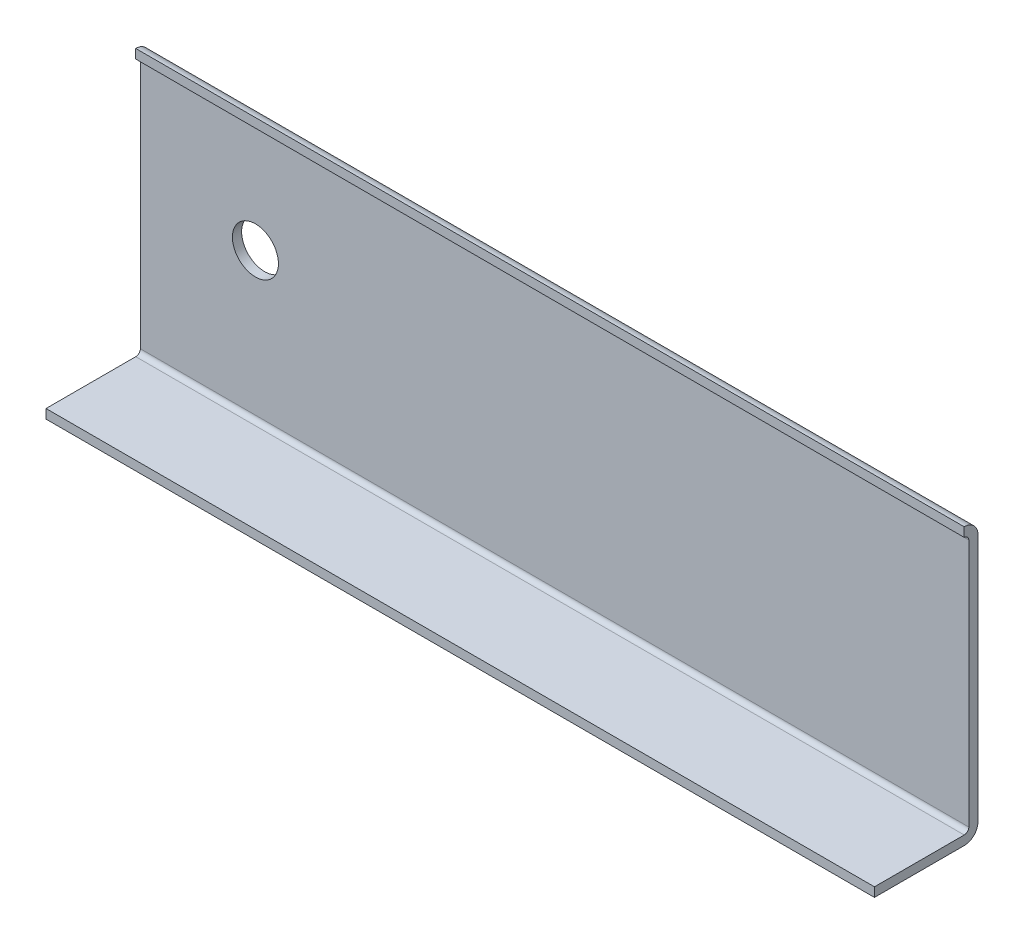
ISO-10303-21;
HEADER;
FILE_DESCRIPTION(('STEP AP214'),'2;1');
FILE_NAME('part.step','',(''),(''),'','','');
FILE_SCHEMA(('AUTOMOTIVE_DESIGN { 1 0 10303 214 1 1 1 1 }'));
ENDSEC;
DATA;
#1=APPLICATION_CONTEXT('core data for automotive mechanical design processes');
#2=APPLICATION_PROTOCOL_DEFINITION('international standard','automotive_design',2000,#1);
#3=PRODUCT_CONTEXT('',#1,'mechanical');
#4=PRODUCT('Part','Part','',(#3));
#5=PRODUCT_RELATED_PRODUCT_CATEGORY('part','',(#4));
#6=PRODUCT_DEFINITION_FORMATION('','',#4);
#7=PRODUCT_DEFINITION_CONTEXT('part definition',#1,'design');
#8=PRODUCT_DEFINITION('design','',#6,#7);
#9=PRODUCT_DEFINITION_SHAPE('','',#8);
#10=(LENGTH_UNIT() NAMED_UNIT(*) SI_UNIT(.MILLI.,.METRE.));
#11=(NAMED_UNIT(*) PLANE_ANGLE_UNIT() SI_UNIT($,.RADIAN.));
#12=(NAMED_UNIT(*) SI_UNIT($,.STERADIAN.) SOLID_ANGLE_UNIT());
#13=UNCERTAINTY_MEASURE_WITH_UNIT(LENGTH_MEASURE(1.E-05),#10,'distance_accuracy_value','');
#14=(GEOMETRIC_REPRESENTATION_CONTEXT(3) GLOBAL_UNCERTAINTY_ASSIGNED_CONTEXT((#13)) GLOBAL_UNIT_ASSIGNED_CONTEXT((#10,
#11,#12)) REPRESENTATION_CONTEXT('',''));
#15=CARTESIAN_POINT('',(0.,0.,0.));
#16=DIRECTION('',(0.,0.,1.));
#17=DIRECTION('',(1.,0.,0.));
#18=AXIS2_PLACEMENT_3D('',#15,#16,#17);
#19=CARTESIAN_POINT('',(180.,1.,-1.));
#20=DIRECTION('',(-1.,0.,0.));
#21=DIRECTION('',(0.,0.,1.));
#22=AXIS2_PLACEMENT_3D('',#19,#20,#21);
#23=PLANE('',#22);
#24=CARTESIAN_POINT('',(180.,55.,-35.));
#25=DIRECTION('',(-1.,0.,0.));
#26=DIRECTION('',(0.,0.,1.));
#27=AXIS2_PLACEMENT_3D('',#24,#25,#26);
#28=CIRCLE('',#27,3.);
#29=CARTESIAN_POINT('',(180.,55.,-38.));
#30=VERTEX_POINT('',#29);
#31=CARTESIAN_POINT('',(180.,58.,-35.));
#32=VERTEX_POINT('',#31);
#33=EDGE_CURVE('E178',#30,#32,#28,.F.);
#34=ORIENTED_EDGE('',*,*,#33,.T.);
#35=DIRECTION('',(0.,1.,0.));
#36=VECTOR('',#35,1.);
#37=CARTESIAN_POINT('',(180.,33.,-35.));
#38=LINE('',#37,#36);
#39=CARTESIAN_POINT('',(180.,56.,-35.));
#40=VERTEX_POINT('',#39);
#41=EDGE_CURVE('E166',#40,#32,#38,.T.);
#42=ORIENTED_EDGE('',*,*,#41,.F.);
#43=CARTESIAN_POINT('',(180.,55.,-35.));
#44=DIRECTION('',(1.,0.,0.));
#45=DIRECTION('',(0.,0.,-1.));
#46=AXIS2_PLACEMENT_3D('',#43,#44,#45);
#47=CIRCLE('',#46,1.);
#48=CARTESIAN_POINT('',(180.,55.,-36.));
#49=VERTEX_POINT('',#48);
#50=EDGE_CURVE('E221',#49,#40,#47,.T.);
#51=ORIENTED_EDGE('',*,*,#50,.F.);
#52=DIRECTION('',(0.,1.,0.));
#53=VECTOR('',#52,1.);
#54=CARTESIAN_POINT('',(180.,1.,-36.));
#55=LINE('',#54,#53);
#56=CARTESIAN_POINT('',(180.,1.,-36.));
#57=VERTEX_POINT('',#56);
#58=EDGE_CURVE('E235',#57,#49,#55,.T.);
#59=ORIENTED_EDGE('',*,*,#58,.F.);
#60=CARTESIAN_POINT('',(180.,1.,-35.));
#61=DIRECTION('',(1.,0.,0.));
#62=DIRECTION('',(0.,0.,-1.));
#63=AXIS2_PLACEMENT_3D('',#60,#61,#62);
#64=CIRCLE('',#63,1.);
#65=CARTESIAN_POINT('',(180.,0.,-35.));
#66=VERTEX_POINT('',#65);
#67=EDGE_CURVE('E237',#66,#57,#64,.T.);
#68=ORIENTED_EDGE('',*,*,#67,.F.);
#69=DIRECTION('',(0.,0.,-1.));
#70=VECTOR('',#69,1.);
#71=CARTESIAN_POINT('',(180.,0.,-1.));
#72=LINE('',#71,#70);
#73=CARTESIAN_POINT('',(180.,0.,-15.5));
#74=VERTEX_POINT('',#73);
#75=EDGE_CURVE('E225',#74,#66,#72,.T.);
#76=ORIENTED_EDGE('',*,*,#75,.F.);
#77=DIRECTION('',(0.,-1.,0.));
#78=VECTOR('',#77,1.);
#79=CARTESIAN_POINT('',(180.,43.,-15.5));
#80=LINE('',#79,#78);
#81=CARTESIAN_POINT('',(180.,-2.,-15.5));
#82=VERTEX_POINT('',#81);
#83=EDGE_CURVE('E96',#74,#82,#80,.T.);
#84=ORIENTED_EDGE('',*,*,#83,.T.);
#85=DIRECTION('',(0.,0.,-1.));
#86=VECTOR('',#85,1.);
#87=CARTESIAN_POINT('',(180.,-2.,-1.));
#88=LINE('',#87,#86);
#89=CARTESIAN_POINT('',(180.,-2.,-35.));
#90=VERTEX_POINT('',#89);
#91=EDGE_CURVE('E126',#82,#90,#88,.T.);
#92=ORIENTED_EDGE('',*,*,#91,.T.);
#93=CARTESIAN_POINT('',(180.,1.,-35.));
#94=DIRECTION('',(-1.,0.,0.));
#95=DIRECTION('',(0.,0.,1.));
#96=AXIS2_PLACEMENT_3D('',#93,#94,#95);
#97=CIRCLE('',#96,3.);
#98=CARTESIAN_POINT('',(180.,1.,-38.));
#99=VERTEX_POINT('',#98);
#100=EDGE_CURVE('E200',#90,#99,#97,.F.);
#101=ORIENTED_EDGE('',*,*,#100,.T.);
#102=DIRECTION('',(0.,1.,0.));
#103=VECTOR('',#102,1.);
#104=CARTESIAN_POINT('',(180.,1.,-38.));
#105=LINE('',#104,#103);
#106=EDGE_CURVE('E105',#99,#30,#105,.T.);
#107=ORIENTED_EDGE('',*,*,#106,.T.);
#108=EDGE_LOOP('',(#34,#42,#51,#59,#68,#76,#84,#92,#101,#107));
#109=FACE_BOUND('',#108,.T.);
#110=ADVANCED_FACE('F81',(#109),#23,.F.);
#111=CARTESIAN_POINT('',(0.,1.,-1.));
#112=DIRECTION('',(-1.,0.,0.));
#113=DIRECTION('',(0.,0.,1.));
#114=AXIS2_PLACEMENT_3D('',#111,#112,#113);
#115=PLANE('',#114);
#116=DIRECTION('',(0.,1.,0.));
#117=VECTOR('',#116,1.);
#118=CARTESIAN_POINT('',(0.,33.,-35.));
#119=LINE('',#118,#117);
#120=CARTESIAN_POINT('',(0.,56.,-35.));
#121=VERTEX_POINT('',#120);
#122=CARTESIAN_POINT('',(0.,58.,-35.));
#123=VERTEX_POINT('',#122);
#124=EDGE_CURVE('E175',#121,#123,#119,.T.);
#125=ORIENTED_EDGE('',*,*,#124,.T.);
#126=CARTESIAN_POINT('',(0.,55.,-35.));
#127=DIRECTION('',(-1.,0.,0.));
#128=DIRECTION('',(0.,0.,1.));
#129=AXIS2_PLACEMENT_3D('',#126,#127,#128);
#130=CIRCLE('',#129,3.);
#131=CARTESIAN_POINT('',(0.,55.,-38.));
#132=VERTEX_POINT('',#131);
#133=EDGE_CURVE('E184',#132,#123,#130,.F.);
#134=ORIENTED_EDGE('',*,*,#133,.F.);
#135=DIRECTION('',(0.,1.,0.));
#136=VECTOR('',#135,1.);
#137=CARTESIAN_POINT('',(0.,1.,-38.));
#138=LINE('',#137,#136);
#139=CARTESIAN_POINT('',(0.,1.,-38.));
#140=VERTEX_POINT('',#139);
#141=EDGE_CURVE('E122',#140,#132,#138,.T.);
#142=ORIENTED_EDGE('',*,*,#141,.F.);
#143=CARTESIAN_POINT('',(0.,1.,-35.));
#144=DIRECTION('',(-1.,0.,0.));
#145=DIRECTION('',(0.,0.,1.));
#146=AXIS2_PLACEMENT_3D('',#143,#144,#145);
#147=CIRCLE('',#146,3.);
#148=CARTESIAN_POINT('',(0.,-2.,-35.));
#149=VERTEX_POINT('',#148);
#150=EDGE_CURVE('E199',#149,#140,#147,.F.);
#151=ORIENTED_EDGE('',*,*,#150,.F.);
#152=DIRECTION('',(0.,0.,-1.));
#153=VECTOR('',#152,1.);
#154=CARTESIAN_POINT('',(0.,-2.,-1.));
#155=LINE('',#154,#153);
#156=CARTESIAN_POINT('',(0.,-2.,-15.5));
#157=VERTEX_POINT('',#156);
#158=EDGE_CURVE('E206',#157,#149,#155,.T.);
#159=ORIENTED_EDGE('',*,*,#158,.F.);
#160=DIRECTION('',(0.,-1.,0.));
#161=VECTOR('',#160,1.);
#162=CARTESIAN_POINT('',(0.,43.,-15.5));
#163=LINE('',#162,#161);
#164=CARTESIAN_POINT('',(0.,0.,-15.5));
#165=VERTEX_POINT('',#164);
#166=EDGE_CURVE('E240',#165,#157,#163,.T.);
#167=ORIENTED_EDGE('',*,*,#166,.F.);
#168=DIRECTION('',(0.,0.,-1.));
#169=VECTOR('',#168,1.);
#170=CARTESIAN_POINT('',(0.,0.,-1.));
#171=LINE('',#170,#169);
#172=CARTESIAN_POINT('',(0.,0.,-35.));
#173=VERTEX_POINT('',#172);
#174=EDGE_CURVE('E232',#165,#173,#171,.T.);
#175=ORIENTED_EDGE('',*,*,#174,.T.);
#176=CARTESIAN_POINT('',(0.,1.,-35.));
#177=DIRECTION('',(1.,0.,0.));
#178=DIRECTION('',(0.,0.,-1.));
#179=AXIS2_PLACEMENT_3D('',#176,#177,#178);
#180=CIRCLE('',#179,1.);
#181=CARTESIAN_POINT('',(0.,1.,-36.));
#182=VERTEX_POINT('',#181);
#183=EDGE_CURVE('E229',#173,#182,#180,.T.);
#184=ORIENTED_EDGE('',*,*,#183,.T.);
#185=DIRECTION('',(0.,1.,0.));
#186=VECTOR('',#185,1.);
#187=CARTESIAN_POINT('',(0.,1.,-36.));
#188=LINE('',#187,#186);
#189=CARTESIAN_POINT('',(0.,55.,-36.));
#190=VERTEX_POINT('',#189);
#191=EDGE_CURVE('E226',#182,#190,#188,.T.);
#192=ORIENTED_EDGE('',*,*,#191,.T.);
#193=CARTESIAN_POINT('',(0.,55.,-35.));
#194=DIRECTION('',(1.,0.,0.));
#195=DIRECTION('',(0.,0.,-1.));
#196=AXIS2_PLACEMENT_3D('',#193,#194,#195);
#197=CIRCLE('',#196,1.);
#198=EDGE_CURVE('E222',#190,#121,#197,.T.);
#199=ORIENTED_EDGE('',*,*,#198,.T.);
#200=EDGE_LOOP('',(#125,#134,#142,#151,#159,#167,#175,#184,#192,#199));
#201=FACE_BOUND('',#200,.T.);
#202=ADVANCED_FACE('F204',(#201),#115,.T.);
#203=CARTESIAN_POINT('',(180.,-2.,-1.));
#204=DIRECTION('',(0.,1.,0.));
#205=DIRECTION('',(0.,0.,1.));
#206=AXIS2_PLACEMENT_3D('',#203,#204,#205);
#207=PLANE('',#206);
#208=ORIENTED_EDGE('',*,*,#91,.F.);
#209=DIRECTION('',(1.,0.,0.));
#210=VECTOR('',#209,1.);
#211=CARTESIAN_POINT('',(0.,-2.,-15.5));
#212=LINE('',#211,#210);
#213=EDGE_CURVE('E242',#157,#82,#212,.T.);
#214=ORIENTED_EDGE('',*,*,#213,.F.);
#215=ORIENTED_EDGE('',*,*,#158,.T.);
#216=DIRECTION('',(-1.,0.,0.));
#217=VECTOR('',#216,1.);
#218=CARTESIAN_POINT('',(180.,-2.,-35.));
#219=LINE('',#218,#217);
#220=EDGE_CURVE('E90',#90,#149,#219,.T.);
#221=ORIENTED_EDGE('',*,*,#220,.F.);
#222=EDGE_LOOP('',(#208,#214,#215,#221));
#223=FACE_BOUND('',#222,.T.);
#224=ADVANCED_FACE('F83',(#223),#207,.F.);
#225=CARTESIAN_POINT('',(180.,1.,-35.));
#226=DIRECTION('',(-1.,0.,0.));
#227=DIRECTION('',(0.,0.,1.));
#228=AXIS2_PLACEMENT_3D('',#225,#226,#227);
#229=CYLINDRICAL_SURFACE('',#228,3.);
#230=ORIENTED_EDGE('',*,*,#150,.T.);
#231=DIRECTION('',(-1.,0.,0.));
#232=VECTOR('',#231,1.);
#233=CARTESIAN_POINT('',(180.,1.,-38.));
#234=LINE('',#233,#232);
#235=EDGE_CURVE('E187',#99,#140,#234,.T.);
#236=ORIENTED_EDGE('',*,*,#235,.F.);
#237=ORIENTED_EDGE('',*,*,#100,.F.);
#238=ORIENTED_EDGE('',*,*,#220,.T.);
#239=EDGE_LOOP('',(#230,#236,#237,#238));
#240=FACE_BOUND('',#239,.T.);
#241=ADVANCED_FACE('F197',(#240),#229,.T.);
#242=CARTESIAN_POINT('',(180.,1.,-38.));
#243=DIRECTION('',(0.,0.,1.));
#244=DIRECTION('',(1.,0.,0.));
#245=AXIS2_PLACEMENT_3D('',#242,#243,#244);
#246=PLANE('',#245);
#247=CARTESIAN_POINT('',(25.,32.,-38.));
#248=DIRECTION('',(0.,0.,-1.));
#249=DIRECTION('',(0.,1.,0.));
#250=AXIS2_PLACEMENT_3D('',#247,#248,#249);
#251=CIRCLE('',#250,5.);
#252=CARTESIAN_POINT('',(25.,37.,-38.));
#253=VERTEX_POINT('',#252);
#254=EDGE_CURVE('E246',#253,#253,#251,.T.);
#255=ORIENTED_EDGE('',*,*,#254,.F.);
#256=EDGE_LOOP('',(#255));
#257=FACE_BOUND('',#256,.T.);
#258=ORIENTED_EDGE('',*,*,#141,.T.);
#259=DIRECTION('',(-1.,0.,0.));
#260=VECTOR('',#259,1.);
#261=CARTESIAN_POINT('',(180.,55.,-38.));
#262=LINE('',#261,#260);
#263=EDGE_CURVE('E185',#30,#132,#262,.T.);
#264=ORIENTED_EDGE('',*,*,#263,.F.);
#265=ORIENTED_EDGE('',*,*,#106,.F.);
#266=ORIENTED_EDGE('',*,*,#235,.T.);
#267=EDGE_LOOP('',(#258,#264,#265,#266));
#268=FACE_BOUND('',#267,.T.);
#269=ADVANCED_FACE('F292',(#257,#268),#246,.F.);
#270=CARTESIAN_POINT('',(180.,55.,-35.));
#271=DIRECTION('',(-1.,0.,0.));
#272=DIRECTION('',(0.,0.,1.));
#273=AXIS2_PLACEMENT_3D('',#270,#271,#272);
#274=CYLINDRICAL_SURFACE('',#273,3.);
#275=ORIENTED_EDGE('',*,*,#133,.T.);
#276=DIRECTION('',(-1.,0.,0.));
#277=VECTOR('',#276,1.);
#278=CARTESIAN_POINT('',(180.,58.,-35.));
#279=LINE('',#278,#277);
#280=EDGE_CURVE('E169',#32,#123,#279,.T.);
#281=ORIENTED_EDGE('',*,*,#280,.F.);
#282=ORIENTED_EDGE('',*,*,#33,.F.);
#283=ORIENTED_EDGE('',*,*,#263,.T.);
#284=EDGE_LOOP('',(#275,#281,#282,#283));
#285=FACE_BOUND('',#284,.T.);
#286=ADVANCED_FACE('F182',(#285),#274,.T.);
#287=CARTESIAN_POINT('',(180.,0.,-1.));
#288=DIRECTION('',(0.,1.,0.));
#289=DIRECTION('',(0.,0.,1.));
#290=AXIS2_PLACEMENT_3D('',#287,#288,#289);
#291=PLANE('',#290);
#292=DIRECTION('',(-1.,0.,0.));
#293=VECTOR('',#292,1.);
#294=CARTESIAN_POINT('',(180.,0.,-15.5));
#295=LINE('',#294,#293);
#296=EDGE_CURVE('E12',#74,#165,#295,.T.);
#297=ORIENTED_EDGE('',*,*,#296,.F.);
#298=ORIENTED_EDGE('',*,*,#75,.T.);
#299=DIRECTION('',(-1.,0.,0.));
#300=VECTOR('',#299,1.);
#301=CARTESIAN_POINT('',(180.,0.,-35.));
#302=LINE('',#301,#300);
#303=EDGE_CURVE('E208',#66,#173,#302,.T.);
#304=ORIENTED_EDGE('',*,*,#303,.T.);
#305=ORIENTED_EDGE('',*,*,#174,.F.);
#306=EDGE_LOOP('',(#297,#298,#304,#305));
#307=FACE_BOUND('',#306,.T.);
#308=ADVANCED_FACE('F287',(#307),#291,.T.);
#309=CARTESIAN_POINT('',(180.,1.,-35.));
#310=DIRECTION('',(-1.,0.,0.));
#311=DIRECTION('',(0.,0.,1.));
#312=AXIS2_PLACEMENT_3D('',#309,#310,#311);
#313=CYLINDRICAL_SURFACE('',#312,1.);
#314=ORIENTED_EDGE('',*,*,#183,.F.);
#315=ORIENTED_EDGE('',*,*,#303,.F.);
#316=ORIENTED_EDGE('',*,*,#67,.T.);
#317=DIRECTION('',(-1.,0.,0.));
#318=VECTOR('',#317,1.);
#319=CARTESIAN_POINT('',(180.,1.,-36.));
#320=LINE('',#319,#318);
#321=EDGE_CURVE('E216',#57,#182,#320,.T.);
#322=ORIENTED_EDGE('',*,*,#321,.T.);
#323=EDGE_LOOP('',(#314,#315,#316,#322));
#324=FACE_BOUND('',#323,.T.);
#325=ADVANCED_FACE('F259',(#324),#313,.F.);
#326=CARTESIAN_POINT('',(180.,1.,-36.));
#327=DIRECTION('',(0.,0.,1.));
#328=DIRECTION('',(1.,0.,0.));
#329=AXIS2_PLACEMENT_3D('',#326,#327,#328);
#330=PLANE('',#329);
#331=CARTESIAN_POINT('',(25.,32.,-36.));
#332=DIRECTION('',(0.,0.,1.));
#333=DIRECTION('',(1.,0.,0.));
#334=AXIS2_PLACEMENT_3D('',#331,#332,#333);
#335=CIRCLE('',#334,5.);
#336=CARTESIAN_POINT('',(30.,32.,-36.));
#337=VERTEX_POINT('',#336);
#338=EDGE_CURVE('E85',#337,#337,#335,.T.);
#339=ORIENTED_EDGE('',*,*,#338,.F.);
#340=EDGE_LOOP('',(#339));
#341=FACE_BOUND('',#340,.T.);
#342=ORIENTED_EDGE('',*,*,#191,.F.);
#343=ORIENTED_EDGE('',*,*,#321,.F.);
#344=ORIENTED_EDGE('',*,*,#58,.T.);
#345=DIRECTION('',(-1.,0.,0.));
#346=VECTOR('',#345,1.);
#347=CARTESIAN_POINT('',(180.,55.,-36.));
#348=LINE('',#347,#346);
#349=EDGE_CURVE('E218',#49,#190,#348,.T.);
#350=ORIENTED_EDGE('',*,*,#349,.T.);
#351=EDGE_LOOP('',(#342,#343,#344,#350));
#352=FACE_BOUND('',#351,.T.);
#353=ADVANCED_FACE('F255',(#341,#352),#330,.T.);
#354=CARTESIAN_POINT('',(180.,55.,-35.));
#355=DIRECTION('',(-1.,0.,0.));
#356=DIRECTION('',(0.,0.,1.));
#357=AXIS2_PLACEMENT_3D('',#354,#355,#356);
#358=CYLINDRICAL_SURFACE('',#357,1.);
#359=ORIENTED_EDGE('',*,*,#198,.F.);
#360=ORIENTED_EDGE('',*,*,#349,.F.);
#361=ORIENTED_EDGE('',*,*,#50,.T.);
#362=DIRECTION('',(-1.,0.,0.));
#363=VECTOR('',#362,1.);
#364=CARTESIAN_POINT('',(180.,56.,-35.));
#365=LINE('',#364,#363);
#366=EDGE_CURVE('E172',#40,#121,#365,.T.);
#367=ORIENTED_EDGE('',*,*,#366,.T.);
#368=EDGE_LOOP('',(#359,#360,#361,#367));
#369=FACE_BOUND('',#368,.T.);
#370=ADVANCED_FACE('F258',(#369),#358,.F.);
#371=CARTESIAN_POINT('',(0.,43.,-15.5));
#372=DIRECTION('',(0.,0.,-1.));
#373=DIRECTION('',(-1.,0.,0.));
#374=AXIS2_PLACEMENT_3D('',#371,#372,#373);
#375=PLANE('',#374);
#376=ORIENTED_EDGE('',*,*,#296,.T.);
#377=ORIENTED_EDGE('',*,*,#166,.T.);
#378=ORIENTED_EDGE('',*,*,#213,.T.);
#379=ORIENTED_EDGE('',*,*,#83,.F.);
#380=EDGE_LOOP('',(#376,#377,#378,#379));
#381=FACE_BOUND('',#380,.T.);
#382=ADVANCED_FACE('F274',(#381),#375,.F.);
#383=CARTESIAN_POINT('',(0.,33.,-35.));
#384=DIRECTION('',(0.,0.,-1.));
#385=DIRECTION('',(-1.,0.,0.));
#386=AXIS2_PLACEMENT_3D('',#383,#384,#385);
#387=PLANE('',#386);
#388=ORIENTED_EDGE('',*,*,#366,.F.);
#389=ORIENTED_EDGE('',*,*,#41,.T.);
#390=ORIENTED_EDGE('',*,*,#280,.T.);
#391=ORIENTED_EDGE('',*,*,#124,.F.);
#392=EDGE_LOOP('',(#388,#389,#390,#391));
#393=FACE_BOUND('',#392,.T.);
#394=ADVANCED_FACE('F167',(#393),#387,.F.);
#395=CARTESIAN_POINT('',(25.,32.,-28.));
#396=DIRECTION('',(0.,0.,-1.));
#397=DIRECTION('',(0.,1.,0.));
#398=AXIS2_PLACEMENT_3D('',#395,#396,#397);
#399=CYLINDRICAL_SURFACE('',#398,5.);
#400=ORIENTED_EDGE('',*,*,#338,.T.);
#401=EDGE_LOOP('',(#400));
#402=FACE_BOUND('',#401,.T.);
#403=ORIENTED_EDGE('',*,*,#254,.T.);
#404=EDGE_LOOP('',(#403));
#405=FACE_BOUND('',#404,.T.);
#406=ADVANCED_FACE('F253',(#402,#405),#399,.F.);
#407=CLOSED_SHELL('',(#110,#202,#224,#241,#269,#286,#308,#325,#353,#370,#382,#394,#406));
#408=MANIFOLD_SOLID_BREP('B2',#407);
#409=ADVANCED_BREP_SHAPE_REPRESENTATION('',(#18,#408),#14);
#410=SHAPE_DEFINITION_REPRESENTATION(#9,#409);
ENDSEC;
END-ISO-10303-21;
